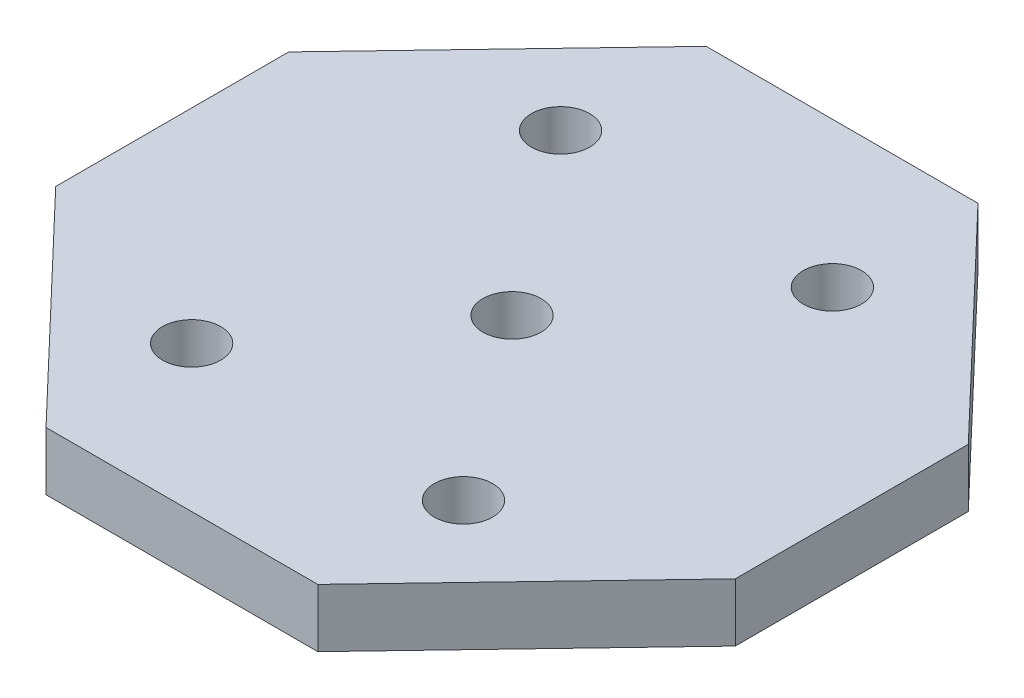
ISO-10303-21;
HEADER;
FILE_DESCRIPTION(('STEP AP214'),'2;1');
FILE_NAME('part.step','',(''),(''),'','','');
FILE_SCHEMA(('AUTOMOTIVE_DESIGN { 1 0 10303 214 1 1 1 1 }'));
ENDSEC;
DATA;
#1=APPLICATION_CONTEXT('core data for automotive mechanical design processes');
#2=APPLICATION_PROTOCOL_DEFINITION('international standard','automotive_design',2000,#1);
#3=PRODUCT_CONTEXT('',#1,'mechanical');
#4=PRODUCT('Part','Part','',(#3));
#5=PRODUCT_RELATED_PRODUCT_CATEGORY('part','',(#4));
#6=PRODUCT_DEFINITION_FORMATION('','',#4);
#7=PRODUCT_DEFINITION_CONTEXT('part definition',#1,'design');
#8=PRODUCT_DEFINITION('design','',#6,#7);
#9=PRODUCT_DEFINITION_SHAPE('','',#8);
#10=(LENGTH_UNIT() NAMED_UNIT(*) SI_UNIT(.MILLI.,.METRE.));
#11=(NAMED_UNIT(*) PLANE_ANGLE_UNIT() SI_UNIT($,.RADIAN.));
#12=(NAMED_UNIT(*) SI_UNIT($,.STERADIAN.) SOLID_ANGLE_UNIT());
#13=UNCERTAINTY_MEASURE_WITH_UNIT(LENGTH_MEASURE(1.E-05),#10,'distance_accuracy_value','');
#14=(GEOMETRIC_REPRESENTATION_CONTEXT(3) GLOBAL_UNCERTAINTY_ASSIGNED_CONTEXT((#13)) GLOBAL_UNIT_ASSIGNED_CONTEXT((#10,
#11,#12)) REPRESENTATION_CONTEXT('',''));
#15=CARTESIAN_POINT('',(0.,0.,0.));
#16=DIRECTION('',(0.,0.,1.));
#17=DIRECTION('',(1.,0.,0.));
#18=AXIS2_PLACEMENT_3D('',#15,#16,#17);
#19=CARTESIAN_POINT('',(12.1535135135135,1.5,11.6010810810811));
#20=DIRECTION('',(0.723355544143572,0.,0.690475746682501));
#21=DIRECTION('',(0.690475746682501,0.,-0.723355544143572));
#22=AXIS2_PLACEMENT_3D('',#19,#20,#21);
#23=PLANE('',#22);
#24=DIRECTION('',(-0.690475746682501,0.,0.723355544143572));
#25=VECTOR('',#24,1.);
#26=CARTESIAN_POINT('',(12.1535135135135,-1.5,11.6010810810811));
#27=LINE('',#26,#25);
#28=CARTESIAN_POINT('',(17.5,-1.5,6.));
#29=VERTEX_POINT('',#28);
#30=CARTESIAN_POINT('',(6.99999999999999,-1.5,17.));
#31=VERTEX_POINT('',#30);
#32=EDGE_CURVE('E145',#29,#31,#27,.T.);
#33=ORIENTED_EDGE('',*,*,#32,.F.);
#34=DIRECTION('',(0.,-1.,0.));
#35=VECTOR('',#34,1.);
#36=CARTESIAN_POINT('',(17.5,1.5,6.));
#37=LINE('',#36,#35);
#38=CARTESIAN_POINT('',(17.5,1.5,6.));
#39=VERTEX_POINT('',#38);
#40=EDGE_CURVE('E11',#39,#29,#37,.T.);
#41=ORIENTED_EDGE('',*,*,#40,.F.);
#42=DIRECTION('',(-0.690475746682501,0.,0.723355544143572));
#43=VECTOR('',#42,1.);
#44=CARTESIAN_POINT('',(12.1535135135135,1.5,11.6010810810811));
#45=LINE('',#44,#43);
#46=CARTESIAN_POINT('',(6.99999999999999,1.5,17.));
#47=VERTEX_POINT('',#46);
#48=EDGE_CURVE('E176',#39,#47,#45,.T.);
#49=ORIENTED_EDGE('',*,*,#48,.T.);
#50=DIRECTION('',(0.,-1.,0.));
#51=VECTOR('',#50,1.);
#52=CARTESIAN_POINT('',(6.99999999999999,1.5,17.));
#53=LINE('',#52,#51);
#54=EDGE_CURVE('E51',#47,#31,#53,.T.);
#55=ORIENTED_EDGE('',*,*,#54,.T.);
#56=EDGE_LOOP('',(#33,#41,#49,#55));
#57=FACE_BOUND('',#56,.T.);
#58=ADVANCED_FACE('F35',(#57),#23,.T.);
#59=CARTESIAN_POINT('',(17.5,1.5,0.));
#60=DIRECTION('',(-1.,0.,0.));
#61=DIRECTION('',(0.,0.,1.));
#62=AXIS2_PLACEMENT_3D('',#59,#60,#61);
#63=PLANE('',#62);
#64=DIRECTION('',(0.,0.,-1.));
#65=VECTOR('',#64,1.);
#66=CARTESIAN_POINT('',(17.5,-1.5,0.));
#67=LINE('',#66,#65);
#68=CARTESIAN_POINT('',(17.5,-1.5,-6.));
#69=VERTEX_POINT('',#68);
#70=EDGE_CURVE('E147',#29,#69,#67,.T.);
#71=ORIENTED_EDGE('',*,*,#70,.T.);
#72=DIRECTION('',(0.,-1.,0.));
#73=VECTOR('',#72,1.);
#74=CARTESIAN_POINT('',(17.5,1.5,-6.));
#75=LINE('',#74,#73);
#76=CARTESIAN_POINT('',(17.5,1.5,-6.));
#77=VERTEX_POINT('',#76);
#78=EDGE_CURVE('E43',#77,#69,#75,.T.);
#79=ORIENTED_EDGE('',*,*,#78,.F.);
#80=DIRECTION('',(0.,0.,-1.));
#81=VECTOR('',#80,1.);
#82=CARTESIAN_POINT('',(17.5,1.5,0.));
#83=LINE('',#82,#81);
#84=EDGE_CURVE('E210',#39,#77,#83,.T.);
#85=ORIENTED_EDGE('',*,*,#84,.F.);
#86=ORIENTED_EDGE('',*,*,#40,.T.);
#87=EDGE_LOOP('',(#71,#79,#85,#86));
#88=FACE_BOUND('',#87,.T.);
#89=ADVANCED_FACE('F228',(#88),#63,.F.);
#90=CARTESIAN_POINT('',(12.1535135135135,1.5,-11.6010810810811));
#91=DIRECTION('',(-0.723355544143572,0.,0.690475746682501));
#92=DIRECTION('',(0.690475746682501,0.,0.723355544143572));
#93=AXIS2_PLACEMENT_3D('',#90,#91,#92);
#94=PLANE('',#93);
#95=DIRECTION('',(-0.690475746682501,0.,-0.723355544143572));
#96=VECTOR('',#95,1.);
#97=CARTESIAN_POINT('',(12.1535135135135,-1.5,-11.6010810810811));
#98=LINE('',#97,#96);
#99=CARTESIAN_POINT('',(6.99999999999999,-1.5,-17.));
#100=VERTEX_POINT('',#99);
#101=EDGE_CURVE('E149',#69,#100,#98,.T.);
#102=ORIENTED_EDGE('',*,*,#101,.T.);
#103=DIRECTION('',(0.,-1.,0.));
#104=VECTOR('',#103,1.);
#105=CARTESIAN_POINT('',(6.99999999999999,1.5,-17.));
#106=LINE('',#105,#104);
#107=CARTESIAN_POINT('',(6.99999999999999,1.5,-17.));
#108=VERTEX_POINT('',#107);
#109=EDGE_CURVE('E183',#108,#100,#106,.T.);
#110=ORIENTED_EDGE('',*,*,#109,.F.);
#111=DIRECTION('',(-0.690475746682501,0.,-0.723355544143572));
#112=VECTOR('',#111,1.);
#113=CARTESIAN_POINT('',(12.1535135135135,1.5,-11.6010810810811));
#114=LINE('',#113,#112);
#115=EDGE_CURVE('E192',#77,#108,#114,.T.);
#116=ORIENTED_EDGE('',*,*,#115,.F.);
#117=ORIENTED_EDGE('',*,*,#78,.T.);
#118=EDGE_LOOP('',(#102,#110,#116,#117));
#119=FACE_BOUND('',#118,.T.);
#120=ADVANCED_FACE('F190',(#119),#94,.F.);
#121=CARTESIAN_POINT('',(0.,1.5,-17.));
#122=DIRECTION('',(0.,0.,1.));
#123=DIRECTION('',(1.,0.,0.));
#124=AXIS2_PLACEMENT_3D('',#121,#122,#123);
#125=PLANE('',#124);
#126=DIRECTION('',(-1.,0.,0.));
#127=VECTOR('',#126,1.);
#128=CARTESIAN_POINT('',(0.,-1.5,-17.));
#129=LINE('',#128,#127);
#130=CARTESIAN_POINT('',(-7.,-1.5,-17.));
#131=VERTEX_POINT('',#130);
#132=EDGE_CURVE('E151',#100,#131,#129,.T.);
#133=ORIENTED_EDGE('',*,*,#132,.T.);
#134=DIRECTION('',(0.,-1.,0.));
#135=VECTOR('',#134,1.);
#136=CARTESIAN_POINT('',(-7.,1.5,-17.));
#137=LINE('',#136,#135);
#138=CARTESIAN_POINT('',(-7.,1.5,-17.));
#139=VERTEX_POINT('',#138);
#140=EDGE_CURVE('E180',#139,#131,#137,.T.);
#141=ORIENTED_EDGE('',*,*,#140,.F.);
#142=DIRECTION('',(-1.,0.,0.));
#143=VECTOR('',#142,1.);
#144=CARTESIAN_POINT('',(0.,1.5,-17.));
#145=LINE('',#144,#143);
#146=EDGE_CURVE('E206',#108,#139,#145,.T.);
#147=ORIENTED_EDGE('',*,*,#146,.F.);
#148=ORIENTED_EDGE('',*,*,#109,.T.);
#149=EDGE_LOOP('',(#133,#141,#147,#148));
#150=FACE_BOUND('',#149,.T.);
#151=ADVANCED_FACE('F202',(#150),#125,.F.);
#152=CARTESIAN_POINT('',(-12.1535135135135,1.5,-11.6010810810811));
#153=DIRECTION('',(0.723355544143572,0.,0.690475746682501));
#154=DIRECTION('',(0.690475746682501,0.,-0.723355544143572));
#155=AXIS2_PLACEMENT_3D('',#152,#153,#154);
#156=PLANE('',#155);
#157=DIRECTION('',(-0.690475746682501,0.,0.723355544143572));
#158=VECTOR('',#157,1.);
#159=CARTESIAN_POINT('',(-12.1535135135135,-1.5,-11.6010810810811));
#160=LINE('',#159,#158);
#161=CARTESIAN_POINT('',(-17.5,-1.5,-6.));
#162=VERTEX_POINT('',#161);
#163=EDGE_CURVE('E153',#131,#162,#160,.T.);
#164=ORIENTED_EDGE('',*,*,#163,.T.);
#165=DIRECTION('',(0.,-1.,0.));
#166=VECTOR('',#165,1.);
#167=CARTESIAN_POINT('',(-17.5,1.5,-6.));
#168=LINE('',#167,#166);
#169=CARTESIAN_POINT('',(-17.5,1.5,-6.));
#170=VERTEX_POINT('',#169);
#171=EDGE_CURVE('E122',#170,#162,#168,.T.);
#172=ORIENTED_EDGE('',*,*,#171,.F.);
#173=DIRECTION('',(-0.690475746682501,0.,0.723355544143572));
#174=VECTOR('',#173,1.);
#175=CARTESIAN_POINT('',(-12.1535135135135,1.5,-11.6010810810811));
#176=LINE('',#175,#174);
#177=EDGE_CURVE('E110',#139,#170,#176,.T.);
#178=ORIENTED_EDGE('',*,*,#177,.F.);
#179=ORIENTED_EDGE('',*,*,#140,.T.);
#180=EDGE_LOOP('',(#164,#172,#178,#179));
#181=FACE_BOUND('',#180,.T.);
#182=ADVANCED_FACE('F205',(#181),#156,.F.);
#183=CARTESIAN_POINT('',(-17.5,1.5,0.));
#184=DIRECTION('',(1.,0.,0.));
#185=DIRECTION('',(0.,0.,-1.));
#186=AXIS2_PLACEMENT_3D('',#183,#184,#185);
#187=PLANE('',#186);
#188=DIRECTION('',(0.,0.,1.));
#189=VECTOR('',#188,1.);
#190=CARTESIAN_POINT('',(-17.5,-1.5,0.));
#191=LINE('',#190,#189);
#192=CARTESIAN_POINT('',(-17.5,-1.5,6.));
#193=VERTEX_POINT('',#192);
#194=EDGE_CURVE('E119',#162,#193,#191,.T.);
#195=ORIENTED_EDGE('',*,*,#194,.T.);
#196=DIRECTION('',(0.,-1.,0.));
#197=VECTOR('',#196,1.);
#198=CARTESIAN_POINT('',(-17.5,1.5,6.));
#199=LINE('',#198,#197);
#200=CARTESIAN_POINT('',(-17.5,1.5,6.));
#201=VERTEX_POINT('',#200);
#202=EDGE_CURVE('E116',#201,#193,#199,.T.);
#203=ORIENTED_EDGE('',*,*,#202,.F.);
#204=DIRECTION('',(0.,0.,1.));
#205=VECTOR('',#204,1.);
#206=CARTESIAN_POINT('',(-17.5,1.5,0.));
#207=LINE('',#206,#205);
#208=EDGE_CURVE('E101',#170,#201,#207,.T.);
#209=ORIENTED_EDGE('',*,*,#208,.F.);
#210=ORIENTED_EDGE('',*,*,#171,.T.);
#211=EDGE_LOOP('',(#195,#203,#209,#210));
#212=FACE_BOUND('',#211,.T.);
#213=ADVANCED_FACE('F117',(#212),#187,.F.);
#214=CARTESIAN_POINT('',(-12.1535135135135,1.5,11.6010810810811));
#215=DIRECTION('',(-0.723355544143572,0.,0.690475746682501));
#216=DIRECTION('',(0.690475746682501,0.,0.723355544143572));
#217=AXIS2_PLACEMENT_3D('',#214,#215,#216);
#218=PLANE('',#217);
#219=DIRECTION('',(-0.690475746682501,0.,-0.723355544143572));
#220=VECTOR('',#219,1.);
#221=CARTESIAN_POINT('',(-12.1535135135135,-1.5,11.6010810810811));
#222=LINE('',#221,#220);
#223=CARTESIAN_POINT('',(-7.,-1.5,17.));
#224=VERTEX_POINT('',#223);
#225=EDGE_CURVE('E156',#224,#193,#222,.T.);
#226=ORIENTED_EDGE('',*,*,#225,.F.);
#227=DIRECTION('',(0.,-1.,0.));
#228=VECTOR('',#227,1.);
#229=CARTESIAN_POINT('',(-7.,1.5,17.));
#230=LINE('',#229,#228);
#231=CARTESIAN_POINT('',(-7.,1.5,17.));
#232=VERTEX_POINT('',#231);
#233=EDGE_CURVE('E76',#232,#224,#230,.T.);
#234=ORIENTED_EDGE('',*,*,#233,.F.);
#235=DIRECTION('',(-0.690475746682501,0.,-0.723355544143572));
#236=VECTOR('',#235,1.);
#237=CARTESIAN_POINT('',(-12.1535135135135,1.5,11.6010810810811));
#238=LINE('',#237,#236);
#239=EDGE_CURVE('E108',#232,#201,#238,.T.);
#240=ORIENTED_EDGE('',*,*,#239,.T.);
#241=ORIENTED_EDGE('',*,*,#202,.T.);
#242=EDGE_LOOP('',(#226,#234,#240,#241));
#243=FACE_BOUND('',#242,.T.);
#244=ADVANCED_FACE('F124',(#243),#218,.T.);
#245=CARTESIAN_POINT('',(7.,1.5,9.5));
#246=DIRECTION('',(0.,-1.,0.));
#247=DIRECTION('',(0.,0.,-1.));
#248=AXIS2_PLACEMENT_3D('',#245,#246,#247);
#249=CYLINDRICAL_SURFACE('',#248,1.5);
#250=CARTESIAN_POINT('',(7.,1.5,9.5));
#251=DIRECTION('',(0.,1.,0.));
#252=DIRECTION('',(0.,0.,1.));
#253=AXIS2_PLACEMENT_3D('',#250,#251,#252);
#254=CIRCLE('',#253,1.5);
#255=CARTESIAN_POINT('',(7.,1.5,11.));
#256=VERTEX_POINT('',#255);
#257=EDGE_CURVE('E139',#256,#256,#254,.F.);
#258=ORIENTED_EDGE('',*,*,#257,.F.);
#259=EDGE_LOOP('',(#258));
#260=FACE_BOUND('',#259,.T.);
#261=CARTESIAN_POINT('',(7.,-1.5,9.5));
#262=DIRECTION('',(0.,1.,0.));
#263=DIRECTION('',(0.,0.,1.));
#264=AXIS2_PLACEMENT_3D('',#261,#262,#263);
#265=CIRCLE('',#264,1.5);
#266=CARTESIAN_POINT('',(7.,-1.5,11.));
#267=VERTEX_POINT('',#266);
#268=EDGE_CURVE('E170',#267,#267,#265,.F.);
#269=ORIENTED_EDGE('',*,*,#268,.T.);
#270=EDGE_LOOP('',(#269));
#271=FACE_BOUND('',#270,.T.);
#272=ADVANCED_FACE('F243',(#260,#271),#249,.F.);
#273=CARTESIAN_POINT('',(7.,1.5,-9.5));
#274=DIRECTION('',(0.,-1.,0.));
#275=DIRECTION('',(0.,0.,-1.));
#276=AXIS2_PLACEMENT_3D('',#273,#274,#275);
#277=CYLINDRICAL_SURFACE('',#276,1.5);
#278=CARTESIAN_POINT('',(7.,1.5,-9.5));
#279=DIRECTION('',(0.,1.,0.));
#280=DIRECTION('',(0.,0.,1.));
#281=AXIS2_PLACEMENT_3D('',#278,#279,#280);
#282=CIRCLE('',#281,1.5);
#283=CARTESIAN_POINT('',(7.,1.5,-8.));
#284=VERTEX_POINT('',#283);
#285=EDGE_CURVE('E136',#284,#284,#282,.T.);
#286=ORIENTED_EDGE('',*,*,#285,.T.);
#287=EDGE_LOOP('',(#286));
#288=FACE_BOUND('',#287,.T.);
#289=CARTESIAN_POINT('',(7.,-1.5,-9.5));
#290=DIRECTION('',(0.,1.,0.));
#291=DIRECTION('',(0.,0.,1.));
#292=AXIS2_PLACEMENT_3D('',#289,#290,#291);
#293=CIRCLE('',#292,1.5);
#294=CARTESIAN_POINT('',(7.,-1.5,-8.));
#295=VERTEX_POINT('',#294);
#296=EDGE_CURVE('E167',#295,#295,#293,.T.);
#297=ORIENTED_EDGE('',*,*,#296,.F.);
#298=EDGE_LOOP('',(#297));
#299=FACE_BOUND('',#298,.T.);
#300=ADVANCED_FACE('F247',(#288,#299),#277,.F.);
#301=CARTESIAN_POINT('',(-7.,1.5,-9.5));
#302=DIRECTION('',(0.,-1.,0.));
#303=DIRECTION('',(0.,0.,-1.));
#304=AXIS2_PLACEMENT_3D('',#301,#302,#303);
#305=CYLINDRICAL_SURFACE('',#304,1.5);
#306=CARTESIAN_POINT('',(-7.,1.5,-9.5));
#307=DIRECTION('',(0.,1.,0.));
#308=DIRECTION('',(0.,0.,1.));
#309=AXIS2_PLACEMENT_3D('',#306,#307,#308);
#310=CIRCLE('',#309,1.5);
#311=CARTESIAN_POINT('',(-7.,1.5,-8.));
#312=VERTEX_POINT('',#311);
#313=EDGE_CURVE('E133',#312,#312,#310,.T.);
#314=ORIENTED_EDGE('',*,*,#313,.T.);
#315=EDGE_LOOP('',(#314));
#316=FACE_BOUND('',#315,.T.);
#317=CARTESIAN_POINT('',(-7.,-1.5,-9.5));
#318=DIRECTION('',(0.,1.,0.));
#319=DIRECTION('',(0.,0.,1.));
#320=AXIS2_PLACEMENT_3D('',#317,#318,#319);
#321=CIRCLE('',#320,1.5);
#322=CARTESIAN_POINT('',(-7.,-1.5,-8.));
#323=VERTEX_POINT('',#322);
#324=EDGE_CURVE('E164',#323,#323,#321,.T.);
#325=ORIENTED_EDGE('',*,*,#324,.F.);
#326=EDGE_LOOP('',(#325));
#327=FACE_BOUND('',#326,.T.);
#328=ADVANCED_FACE('F223',(#316,#327),#305,.F.);
#329=CARTESIAN_POINT('',(0.,1.5,0.));
#330=DIRECTION('',(0.,-1.,0.));
#331=DIRECTION('',(0.,0.,-1.));
#332=AXIS2_PLACEMENT_3D('',#329,#330,#331);
#333=CYLINDRICAL_SURFACE('',#332,1.5);
#334=CARTESIAN_POINT('',(0.,1.5,0.));
#335=DIRECTION('',(0.,1.,0.));
#336=DIRECTION('',(0.,0.,1.));
#337=AXIS2_PLACEMENT_3D('',#334,#335,#336);
#338=CIRCLE('',#337,1.5);
#339=CARTESIAN_POINT('',(0.,1.5,1.5));
#340=VERTEX_POINT('',#339);
#341=EDGE_CURVE('E127',#340,#340,#338,.T.);
#342=ORIENTED_EDGE('',*,*,#341,.T.);
#343=EDGE_LOOP('',(#342));
#344=FACE_BOUND('',#343,.T.);
#345=CARTESIAN_POINT('',(0.,-1.5,0.));
#346=DIRECTION('',(0.,1.,0.));
#347=DIRECTION('',(0.,0.,1.));
#348=AXIS2_PLACEMENT_3D('',#345,#346,#347);
#349=CIRCLE('',#348,1.5);
#350=CARTESIAN_POINT('',(0.,-1.5,1.5));
#351=VERTEX_POINT('',#350);
#352=EDGE_CURVE('E161',#351,#351,#349,.T.);
#353=ORIENTED_EDGE('',*,*,#352,.F.);
#354=EDGE_LOOP('',(#353));
#355=FACE_BOUND('',#354,.T.);
#356=ADVANCED_FACE('F215',(#344,#355),#333,.F.);
#357=CARTESIAN_POINT('',(0.,1.5,17.));
#358=DIRECTION('',(0.,0.,1.));
#359=DIRECTION('',(1.,0.,0.));
#360=AXIS2_PLACEMENT_3D('',#357,#358,#359);
#361=PLANE('',#360);
#362=DIRECTION('',(-1.,0.,0.));
#363=VECTOR('',#362,1.);
#364=CARTESIAN_POINT('',(0.,-1.5,17.));
#365=LINE('',#364,#363);
#366=EDGE_CURVE('E158',#31,#224,#365,.T.);
#367=ORIENTED_EDGE('',*,*,#366,.F.);
#368=ORIENTED_EDGE('',*,*,#54,.F.);
#369=DIRECTION('',(-1.,0.,0.));
#370=VECTOR('',#369,1.);
#371=CARTESIAN_POINT('',(0.,1.5,17.));
#372=LINE('',#371,#370);
#373=EDGE_CURVE('E125',#47,#232,#372,.T.);
#374=ORIENTED_EDGE('',*,*,#373,.T.);
#375=ORIENTED_EDGE('',*,*,#233,.T.);
#376=EDGE_LOOP('',(#367,#368,#374,#375));
#377=FACE_BOUND('',#376,.T.);
#378=ADVANCED_FACE('F212',(#377),#361,.T.);
#379=CARTESIAN_POINT('',(-7.,1.5,9.5));
#380=DIRECTION('',(0.,-1.,0.));
#381=DIRECTION('',(0.,0.,-1.));
#382=AXIS2_PLACEMENT_3D('',#379,#380,#381);
#383=CYLINDRICAL_SURFACE('',#382,1.5);
#384=CARTESIAN_POINT('',(-7.,1.5,9.5));
#385=DIRECTION('',(0.,1.,0.));
#386=DIRECTION('',(0.,0.,1.));
#387=AXIS2_PLACEMENT_3D('',#384,#385,#386);
#388=CIRCLE('',#387,1.5);
#389=CARTESIAN_POINT('',(-7.,1.5,11.));
#390=VERTEX_POINT('',#389);
#391=EDGE_CURVE('E142',#390,#390,#388,.F.);
#392=ORIENTED_EDGE('',*,*,#391,.F.);
#393=EDGE_LOOP('',(#392));
#394=FACE_BOUND('',#393,.T.);
#395=CARTESIAN_POINT('',(-7.,-1.5,9.5));
#396=DIRECTION('',(0.,1.,0.));
#397=DIRECTION('',(0.,0.,1.));
#398=AXIS2_PLACEMENT_3D('',#395,#396,#397);
#399=CIRCLE('',#398,1.5);
#400=CARTESIAN_POINT('',(-7.,-1.5,11.));
#401=VERTEX_POINT('',#400);
#402=EDGE_CURVE('E173',#401,#401,#399,.F.);
#403=ORIENTED_EDGE('',*,*,#402,.T.);
#404=EDGE_LOOP('',(#403));
#405=FACE_BOUND('',#404,.T.);
#406=ADVANCED_FACE('F214',(#394,#405),#383,.F.);
#407=CARTESIAN_POINT('',(0.,1.5,0.));
#408=DIRECTION('',(0.,1.,0.));
#409=DIRECTION('',(0.,0.,1.));
#410=AXIS2_PLACEMENT_3D('',#407,#408,#409);
#411=PLANE('',#410);
#412=ORIENTED_EDGE('',*,*,#48,.F.);
#413=ORIENTED_EDGE('',*,*,#84,.T.);
#414=ORIENTED_EDGE('',*,*,#115,.T.);
#415=ORIENTED_EDGE('',*,*,#146,.T.);
#416=ORIENTED_EDGE('',*,*,#177,.T.);
#417=ORIENTED_EDGE('',*,*,#208,.T.);
#418=ORIENTED_EDGE('',*,*,#239,.F.);
#419=ORIENTED_EDGE('',*,*,#373,.F.);
#420=EDGE_LOOP('',(#412,#413,#414,#415,#416,#417,#418,#419));
#421=FACE_BOUND('',#420,.T.);
#422=ORIENTED_EDGE('',*,*,#341,.F.);
#423=EDGE_LOOP('',(#422));
#424=FACE_BOUND('',#423,.T.);
#425=ORIENTED_EDGE('',*,*,#313,.F.);
#426=EDGE_LOOP('',(#425));
#427=FACE_BOUND('',#426,.T.);
#428=ORIENTED_EDGE('',*,*,#285,.F.);
#429=EDGE_LOOP('',(#428));
#430=FACE_BOUND('',#429,.T.);
#431=ORIENTED_EDGE('',*,*,#257,.T.);
#432=EDGE_LOOP('',(#431));
#433=FACE_BOUND('',#432,.T.);
#434=ORIENTED_EDGE('',*,*,#391,.T.);
#435=EDGE_LOOP('',(#434));
#436=FACE_BOUND('',#435,.T.);
#437=ADVANCED_FACE('F104',(#421,#424,#427,#430,#433,#436),#411,.T.);
#438=CARTESIAN_POINT('',(0.,-1.5,0.));
#439=DIRECTION('',(0.,1.,0.));
#440=DIRECTION('',(0.,0.,1.));
#441=AXIS2_PLACEMENT_3D('',#438,#439,#440);
#442=PLANE('',#441);
#443=ORIENTED_EDGE('',*,*,#32,.T.);
#444=ORIENTED_EDGE('',*,*,#366,.T.);
#445=ORIENTED_EDGE('',*,*,#225,.T.);
#446=ORIENTED_EDGE('',*,*,#194,.F.);
#447=ORIENTED_EDGE('',*,*,#163,.F.);
#448=ORIENTED_EDGE('',*,*,#132,.F.);
#449=ORIENTED_EDGE('',*,*,#101,.F.);
#450=ORIENTED_EDGE('',*,*,#70,.F.);
#451=EDGE_LOOP('',(#443,#444,#445,#446,#447,#448,#449,#450));
#452=FACE_BOUND('',#451,.T.);
#453=ORIENTED_EDGE('',*,*,#352,.T.);
#454=EDGE_LOOP('',(#453));
#455=FACE_BOUND('',#454,.T.);
#456=ORIENTED_EDGE('',*,*,#324,.T.);
#457=EDGE_LOOP('',(#456));
#458=FACE_BOUND('',#457,.T.);
#459=ORIENTED_EDGE('',*,*,#296,.T.);
#460=EDGE_LOOP('',(#459));
#461=FACE_BOUND('',#460,.T.);
#462=ORIENTED_EDGE('',*,*,#268,.F.);
#463=EDGE_LOOP('',(#462));
#464=FACE_BOUND('',#463,.T.);
#465=ORIENTED_EDGE('',*,*,#402,.F.);
#466=EDGE_LOOP('',(#465));
#467=FACE_BOUND('',#466,.T.);
#468=ADVANCED_FACE('F197',(#452,#455,#458,#461,#464,#467),#442,.F.);
#469=CLOSED_SHELL('',(#58,#89,#120,#151,#182,#213,#244,#272,#300,#328,#356,#378,#406,#437,#468));
#470=MANIFOLD_SOLID_BREP('B2',#469);
#471=ADVANCED_BREP_SHAPE_REPRESENTATION('',(#18,#470),#14);
#472=SHAPE_DEFINITION_REPRESENTATION(#9,#471);
ENDSEC;
END-ISO-10303-21;
